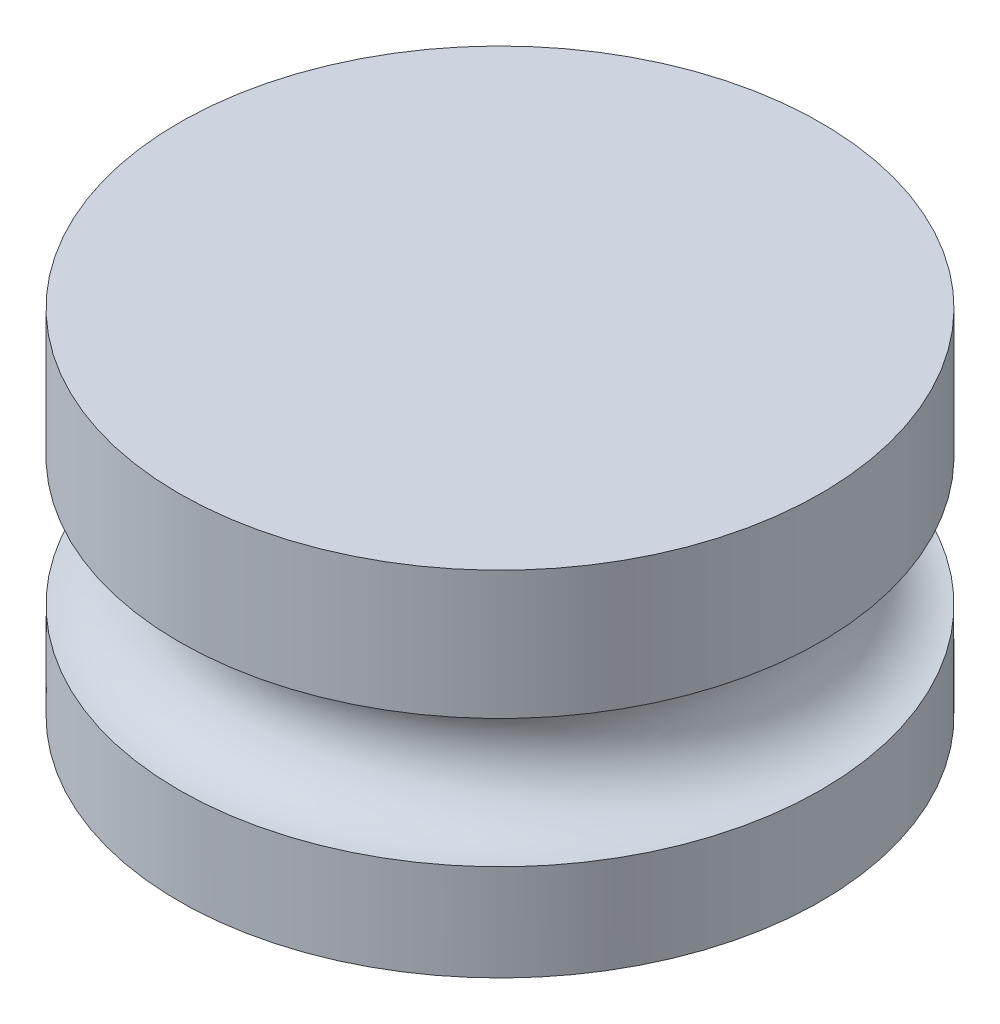
ISO-10303-21;
HEADER;
FILE_DESCRIPTION(('STEP AP214'),'2;1');
FILE_NAME('part.step','',(''),(''),'','','');
FILE_SCHEMA(('AUTOMOTIVE_DESIGN { 1 0 10303 214 1 1 1 1 }'));
ENDSEC;
DATA;
#1=APPLICATION_CONTEXT('core data for automotive mechanical design processes');
#2=APPLICATION_PROTOCOL_DEFINITION('international standard','automotive_design',2000,#1);
#3=PRODUCT_CONTEXT('',#1,'mechanical');
#4=PRODUCT('Part','Part','',(#3));
#5=PRODUCT_RELATED_PRODUCT_CATEGORY('part','',(#4));
#6=PRODUCT_DEFINITION_FORMATION('','',#4);
#7=PRODUCT_DEFINITION_CONTEXT('part definition',#1,'design');
#8=PRODUCT_DEFINITION('design','',#6,#7);
#9=PRODUCT_DEFINITION_SHAPE('','',#8);
#10=(LENGTH_UNIT() NAMED_UNIT(*) SI_UNIT(.MILLI.,.METRE.));
#11=(NAMED_UNIT(*) PLANE_ANGLE_UNIT() SI_UNIT($,.RADIAN.));
#12=(NAMED_UNIT(*) SI_UNIT($,.STERADIAN.) SOLID_ANGLE_UNIT());
#13=UNCERTAINTY_MEASURE_WITH_UNIT(LENGTH_MEASURE(1.E-05),#10,'distance_accuracy_value','');
#14=(GEOMETRIC_REPRESENTATION_CONTEXT(3) GLOBAL_UNCERTAINTY_ASSIGNED_CONTEXT((#13)) GLOBAL_UNIT_ASSIGNED_CONTEXT((#10,
#11,#12)) REPRESENTATION_CONTEXT('',''));
#15=CARTESIAN_POINT('',(0.,0.,0.));
#16=DIRECTION('',(0.,0.,1.));
#17=DIRECTION('',(1.,0.,0.));
#18=AXIS2_PLACEMENT_3D('',#15,#16,#17);
#19=CARTESIAN_POINT('',(0.,4.,0.));
#20=DIRECTION('',(0.,-1.,0.));
#21=DIRECTION('',(0.,0.,-1.));
#22=AXIS2_PLACEMENT_3D('',#19,#20,#21);
#23=CYLINDRICAL_SURFACE('',#22,5.);
#24=CARTESIAN_POINT('',(0.,3.,0.));
#25=DIRECTION('',(0.,-1.,0.));
#26=DIRECTION('',(0.,0.,-1.));
#27=AXIS2_PLACEMENT_3D('',#24,#25,#26);
#28=CIRCLE('',#27,5.);
#29=CARTESIAN_POINT('',(0.,3.,5.));
#30=VERTEX_POINT('',#29);
#31=EDGE_CURVE('E12',#30,#30,#28,.F.);
#32=ORIENTED_EDGE('',*,*,#31,.T.);
#33=EDGE_LOOP('',(#32));
#34=FACE_BOUND('',#33,.T.);
#35=CARTESIAN_POINT('',(0.,5.,0.));
#36=DIRECTION('',(0.,1.,0.));
#37=DIRECTION('',(0.,0.,1.));
#38=AXIS2_PLACEMENT_3D('',#35,#36,#37);
#39=CIRCLE('',#38,5.);
#40=CARTESIAN_POINT('',(0.,5.,5.));
#41=VERTEX_POINT('',#40);
#42=EDGE_CURVE('E78',#41,#41,#39,.T.);
#43=ORIENTED_EDGE('',*,*,#42,.F.);
#44=EDGE_LOOP('',(#43));
#45=FACE_BOUND('',#44,.T.);
#46=ADVANCED_FACE('F57',(#34,#45),#23,.T.);
#47=CARTESIAN_POINT('',(0.,1.,0.));
#48=DIRECTION('',(0.,1.,0.));
#49=DIRECTION('',(0.,0.,1.));
#50=AXIS2_PLACEMENT_3D('',#47,#48,#49);
#51=CIRCLE('',#50,5.);
#52=CARTESIAN_POINT('',(0.,1.,5.));
#53=VERTEX_POINT('',#52);
#54=EDGE_CURVE('E65',#53,#53,#51,.F.);
#55=ORIENTED_EDGE('',*,*,#54,.T.);
#56=EDGE_LOOP('',(#55));
#57=FACE_BOUND('',#56,.T.);
#58=CARTESIAN_POINT('',(0.,-0.5,0.));
#59=DIRECTION('',(0.,-1.,0.));
#60=DIRECTION('',(0.,0.,-1.));
#61=AXIS2_PLACEMENT_3D('',#58,#59,#60);
#62=CIRCLE('',#61,5.);
#63=CARTESIAN_POINT('',(0.,-0.5,-5.));
#64=VERTEX_POINT('',#63);
#65=EDGE_CURVE('E83',#64,#64,#62,.T.);
#66=ORIENTED_EDGE('',*,*,#65,.F.);
#67=EDGE_LOOP('',(#66));
#68=FACE_BOUND('',#67,.T.);
#69=ADVANCED_FACE('F108',(#57,#68),#23,.T.);
#70=CARTESIAN_POINT('',(0.,2.,0.));
#71=DIRECTION('',(0.,1.,0.));
#72=DIRECTION('',(0.,0.,1.));
#73=AXIS2_PLACEMENT_3D('',#70,#71,#72);
#74=TOROIDAL_SURFACE('',#73,5.,1.);
#75=CARTESIAN_POINT('',(0.,2.,5.));
#76=DIRECTION('',(1.,0.,0.));
#77=DIRECTION('',(0.,0.,-1.));
#78=AXIS2_PLACEMENT_3D('',#75,#76,#77);
#79=CIRCLE('',#78,1.);
#80=EDGE_CURVE('E72',#53,#30,#79,.T.);
#81=ORIENTED_EDGE('',*,*,#80,.F.);
#82=ORIENTED_EDGE('',*,*,#54,.F.);
#83=ORIENTED_EDGE('',*,*,#80,.T.);
#84=ORIENTED_EDGE('',*,*,#31,.F.);
#85=EDGE_LOOP('',(#81,#82,#83,#84));
#86=FACE_BOUND('',#85,.T.);
#87=ADVANCED_FACE('F73',(#86),#74,.F.);
#88=CARTESIAN_POINT('',(0.,5.,0.));
#89=DIRECTION('',(0.,1.,0.));
#90=DIRECTION('',(0.,0.,1.));
#91=AXIS2_PLACEMENT_3D('',#88,#89,#90);
#92=PLANE('',#91);
#93=ORIENTED_EDGE('',*,*,#42,.T.);
#94=EDGE_LOOP('',(#93));
#95=FACE_BOUND('',#94,.T.);
#96=ADVANCED_FACE('F94',(#95),#92,.T.);
#97=CARTESIAN_POINT('',(0.,-0.5,0.));
#98=DIRECTION('',(0.,-1.,0.));
#99=DIRECTION('',(0.,0.,-1.));
#100=AXIS2_PLACEMENT_3D('',#97,#98,#99);
#101=PLANE('',#100);
#102=ORIENTED_EDGE('',*,*,#65,.T.);
#103=EDGE_LOOP('',(#102));
#104=FACE_BOUND('',#103,.T.);
#105=CARTESIAN_POINT('',(0.,-0.5,0.));
#106=DIRECTION('',(0.,-1.,0.));
#107=DIRECTION('',(0.,0.,-1.));
#108=AXIS2_PLACEMENT_3D('',#105,#106,#107);
#109=CIRCLE('',#108,1.);
#110=CARTESIAN_POINT('',(0.,-0.5,-1.));
#111=VERTEX_POINT('',#110);
#112=EDGE_CURVE('E86',#111,#111,#109,.T.);
#113=ORIENTED_EDGE('',*,*,#112,.F.);
#114=EDGE_LOOP('',(#113));
#115=FACE_BOUND('',#114,.T.);
#116=ADVANCED_FACE('F91',(#104,#115),#101,.T.);
#117=CARTESIAN_POINT('',(0.,4.,0.));
#118=DIRECTION('',(0.,1.,0.));
#119=DIRECTION('',(0.,0.,1.));
#120=AXIS2_PLACEMENT_3D('',#117,#118,#119);
#121=PLANE('',#120);
#122=CARTESIAN_POINT('',(0.,4.,0.));
#123=DIRECTION('',(0.,1.,0.));
#124=DIRECTION('',(0.,0.,1.));
#125=AXIS2_PLACEMENT_3D('',#122,#123,#124);
#126=CIRCLE('',#125,1.);
#127=CARTESIAN_POINT('',(0.,4.,1.));
#128=VERTEX_POINT('',#127);
#129=EDGE_CURVE('E75',#128,#128,#126,.T.);
#130=ORIENTED_EDGE('',*,*,#129,.F.);
#131=EDGE_LOOP('',(#130));
#132=FACE_BOUND('',#131,.T.);
#133=ADVANCED_FACE('F93',(#132),#121,.F.);
#134=CARTESIAN_POINT('',(0.,4.,0.));
#135=DIRECTION('',(0.,-1.,0.));
#136=DIRECTION('',(0.,0.,-1.));
#137=AXIS2_PLACEMENT_3D('',#134,#135,#136);
#138=CYLINDRICAL_SURFACE('',#137,1.);
#139=ORIENTED_EDGE('',*,*,#129,.T.);
#140=EDGE_LOOP('',(#139));
#141=FACE_BOUND('',#140,.T.);
#142=ORIENTED_EDGE('',*,*,#112,.T.);
#143=EDGE_LOOP('',(#142));
#144=FACE_BOUND('',#143,.T.);
#145=ADVANCED_FACE('F59',(#141,#144),#138,.F.);
#146=CLOSED_SHELL('',(#46,#69,#87,#96,#116,#133,#145));
#147=MANIFOLD_SOLID_BREP('B2',#146);
#148=ADVANCED_BREP_SHAPE_REPRESENTATION('',(#18,#147),#14);
#149=SHAPE_DEFINITION_REPRESENTATION(#9,#148);
ENDSEC;
END-ISO-10303-21;
